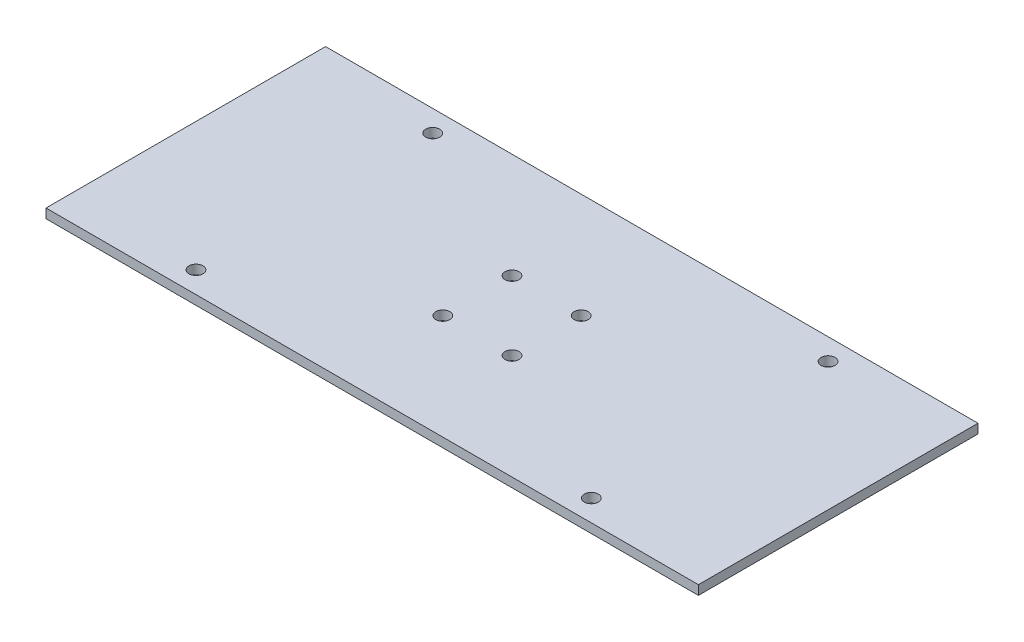
ISO-10303-21;
HEADER;
FILE_DESCRIPTION(('STEP AP214'),'2;1');
FILE_NAME('part.step','',(''),(''),'','','');
FILE_SCHEMA(('AUTOMOTIVE_DESIGN { 1 0 10303 214 1 1 1 1 }'));
ENDSEC;
DATA;
#1=APPLICATION_CONTEXT('core data for automotive mechanical design processes');
#2=APPLICATION_PROTOCOL_DEFINITION('international standard','automotive_design',2000,#1);
#3=PRODUCT_CONTEXT('',#1,'mechanical');
#4=PRODUCT('Part','Part','',(#3));
#5=PRODUCT_RELATED_PRODUCT_CATEGORY('part','',(#4));
#6=PRODUCT_DEFINITION_FORMATION('','',#4);
#7=PRODUCT_DEFINITION_CONTEXT('part definition',#1,'design');
#8=PRODUCT_DEFINITION('design','',#6,#7);
#9=PRODUCT_DEFINITION_SHAPE('','',#8);
#10=(LENGTH_UNIT() NAMED_UNIT(*) SI_UNIT(.MILLI.,.METRE.));
#11=(NAMED_UNIT(*) PLANE_ANGLE_UNIT() SI_UNIT($,.RADIAN.));
#12=(NAMED_UNIT(*) SI_UNIT($,.STERADIAN.) SOLID_ANGLE_UNIT());
#13=UNCERTAINTY_MEASURE_WITH_UNIT(LENGTH_MEASURE(1.E-05),#10,'distance_accuracy_value','');
#14=(GEOMETRIC_REPRESENTATION_CONTEXT(3) GLOBAL_UNCERTAINTY_ASSIGNED_CONTEXT((#13)) GLOBAL_UNIT_ASSIGNED_CONTEXT((#10,
#11,#12)) REPRESENTATION_CONTEXT('',''));
#15=CARTESIAN_POINT('',(0.,0.,0.));
#16=DIRECTION('',(0.,0.,1.));
#17=DIRECTION('',(1.,0.,0.));
#18=AXIS2_PLACEMENT_3D('',#15,#16,#17);
#19=CARTESIAN_POINT('',(0.,2.,0.));
#20=DIRECTION('',(0.,1.,0.));
#21=DIRECTION('',(0.,0.,1.));
#22=AXIS2_PLACEMENT_3D('',#19,#20,#21);
#23=PLANE('',#22);
#24=CARTESIAN_POINT('',(7.42499999999995,2.,7.42500000000005));
#25=DIRECTION('',(0.,1.,0.));
#26=DIRECTION('',(0.,0.,1.));
#27=AXIS2_PLACEMENT_3D('',#24,#25,#26);
#28=CIRCLE('',#27,1.5);
#29=CARTESIAN_POINT('',(7.42499999999995,2.,8.92500000000005));
#30=VERTEX_POINT('',#29);
#31=EDGE_CURVE('E174',#30,#30,#28,.T.);
#32=ORIENTED_EDGE('',*,*,#31,.F.);
#33=EDGE_LOOP('',(#32));
#34=FACE_BOUND('',#33,.T.);
#35=CARTESIAN_POINT('',(-7.425,2.,-7.425));
#36=DIRECTION('',(0.,1.,0.));
#37=DIRECTION('',(0.,0.,1.));
#38=AXIS2_PLACEMENT_3D('',#35,#36,#37);
#39=CIRCLE('',#38,1.5);
#40=CARTESIAN_POINT('',(-7.425,2.,-5.925));
#41=VERTEX_POINT('',#40);
#42=EDGE_CURVE('E158',#41,#41,#39,.T.);
#43=ORIENTED_EDGE('',*,*,#42,.F.);
#44=EDGE_LOOP('',(#43));
#45=FACE_BOUND('',#44,.T.);
#46=CARTESIAN_POINT('',(42.42,2.,25.4));
#47=DIRECTION('',(0.,1.,0.));
#48=DIRECTION('',(0.,0.,1.));
#49=AXIS2_PLACEMENT_3D('',#46,#47,#48);
#50=CIRCLE('',#49,1.5);
#51=CARTESIAN_POINT('',(42.42,2.,26.9));
#52=VERTEX_POINT('',#51);
#53=EDGE_CURVE('E142',#52,#52,#50,.T.);
#54=ORIENTED_EDGE('',*,*,#53,.F.);
#55=EDGE_LOOP('',(#54));
#56=FACE_BOUND('',#55,.T.);
#57=CARTESIAN_POINT('',(-42.42,2.,-25.4));
#58=DIRECTION('',(0.,1.,0.));
#59=DIRECTION('',(0.,0.,1.));
#60=AXIS2_PLACEMENT_3D('',#57,#58,#59);
#61=CIRCLE('',#60,1.5);
#62=CARTESIAN_POINT('',(-42.42,2.,-23.9));
#63=VERTEX_POINT('',#62);
#64=EDGE_CURVE('E112',#63,#63,#61,.T.);
#65=ORIENTED_EDGE('',*,*,#64,.F.);
#66=EDGE_LOOP('',(#65));
#67=FACE_BOUND('',#66,.T.);
#68=DIRECTION('',(0.,0.,-1.));
#69=VECTOR('',#68,1.);
#70=CARTESIAN_POINT('',(70.,2.,-30.));
#71=LINE('',#70,#69);
#72=CARTESIAN_POINT('',(70.,2.,30.));
#73=VERTEX_POINT('',#72);
#74=CARTESIAN_POINT('',(70.,2.,-30.));
#75=VERTEX_POINT('',#74);
#76=EDGE_CURVE('E92',#73,#75,#71,.T.);
#77=ORIENTED_EDGE('',*,*,#76,.T.);
#78=DIRECTION('',(-1.,0.,0.));
#79=VECTOR('',#78,1.);
#80=CARTESIAN_POINT('',(-70.,2.,-30.));
#81=LINE('',#80,#79);
#82=CARTESIAN_POINT('',(-70.,2.,-30.));
#83=VERTEX_POINT('',#82);
#84=EDGE_CURVE('E87',#75,#83,#81,.T.);
#85=ORIENTED_EDGE('',*,*,#84,.T.);
#86=DIRECTION('',(0.,0.,1.));
#87=VECTOR('',#86,1.);
#88=CARTESIAN_POINT('',(-70.,2.,-30.));
#89=LINE('',#88,#87);
#90=CARTESIAN_POINT('',(-70.,2.,30.));
#91=VERTEX_POINT('',#90);
#92=EDGE_CURVE('E90',#83,#91,#89,.T.);
#93=ORIENTED_EDGE('',*,*,#92,.T.);
#94=DIRECTION('',(1.,0.,0.));
#95=VECTOR('',#94,1.);
#96=CARTESIAN_POINT('',(-70.,2.,30.));
#97=LINE('',#96,#95);
#98=EDGE_CURVE('E57',#91,#73,#97,.T.);
#99=ORIENTED_EDGE('',*,*,#98,.T.);
#100=EDGE_LOOP('',(#77,#85,#93,#99));
#101=FACE_BOUND('',#100,.T.);
#102=CARTESIAN_POINT('',(-42.42,2.,25.4));
#103=DIRECTION('',(0.,1.,0.));
#104=DIRECTION('',(0.,0.,-1.));
#105=AXIS2_PLACEMENT_3D('',#102,#103,#104);
#106=CIRCLE('',#105,1.5);
#107=CARTESIAN_POINT('',(-42.42,2.,23.9));
#108=VERTEX_POINT('',#107);
#109=EDGE_CURVE('E134',#108,#108,#106,.T.);
#110=ORIENTED_EDGE('',*,*,#109,.F.);
#111=EDGE_LOOP('',(#110));
#112=FACE_BOUND('',#111,.T.);
#113=CARTESIAN_POINT('',(42.42,2.,-25.4));
#114=DIRECTION('',(0.,1.,0.));
#115=DIRECTION('',(0.,0.,-1.));
#116=AXIS2_PLACEMENT_3D('',#113,#114,#115);
#117=CIRCLE('',#116,1.5);
#118=CARTESIAN_POINT('',(42.42,2.,-26.9));
#119=VERTEX_POINT('',#118);
#120=EDGE_CURVE('E150',#119,#119,#117,.T.);
#121=ORIENTED_EDGE('',*,*,#120,.F.);
#122=EDGE_LOOP('',(#121));
#123=FACE_BOUND('',#122,.T.);
#124=CARTESIAN_POINT('',(7.42500000000003,2.,-7.42499999999997));
#125=DIRECTION('',(0.,1.,0.));
#126=DIRECTION('',(0.,0.,1.));
#127=AXIS2_PLACEMENT_3D('',#124,#125,#126);
#128=CIRCLE('',#127,1.5);
#129=CARTESIAN_POINT('',(7.42500000000003,2.,-5.92499999999998));
#130=VERTEX_POINT('',#129);
#131=EDGE_CURVE('E166',#130,#130,#128,.T.);
#132=ORIENTED_EDGE('',*,*,#131,.F.);
#133=EDGE_LOOP('',(#132));
#134=FACE_BOUND('',#133,.T.);
#135=CARTESIAN_POINT('',(-7.42500000000008,2.,7.42499999999992));
#136=DIRECTION('',(0.,1.,0.));
#137=DIRECTION('',(0.,0.,1.));
#138=AXIS2_PLACEMENT_3D('',#135,#136,#137);
#139=CIRCLE('',#138,1.5);
#140=CARTESIAN_POINT('',(-7.42500000000008,2.,8.92499999999992));
#141=VERTEX_POINT('',#140);
#142=EDGE_CURVE('E182',#141,#141,#139,.T.);
#143=ORIENTED_EDGE('',*,*,#142,.F.);
#144=EDGE_LOOP('',(#143));
#145=FACE_BOUND('',#144,.T.);
#146=ADVANCED_FACE('F39',(#34,#45,#56,#67,#101,#112,#123,#134,#145),#23,.T.);
#147=CARTESIAN_POINT('',(0.,0.,0.));
#148=DIRECTION('',(0.,1.,0.));
#149=DIRECTION('',(0.,0.,1.));
#150=AXIS2_PLACEMENT_3D('',#147,#148,#149);
#151=PLANE('',#150);
#152=DIRECTION('',(0.,0.,-1.));
#153=VECTOR('',#152,1.);
#154=CARTESIAN_POINT('',(70.,0.,-30.));
#155=LINE('',#154,#153);
#156=CARTESIAN_POINT('',(70.,0.,30.));
#157=VERTEX_POINT('',#156);
#158=CARTESIAN_POINT('',(70.,0.,-30.));
#159=VERTEX_POINT('',#158);
#160=EDGE_CURVE('E108',#157,#159,#155,.T.);
#161=ORIENTED_EDGE('',*,*,#160,.F.);
#162=DIRECTION('',(1.,0.,0.));
#163=VECTOR('',#162,1.);
#164=CARTESIAN_POINT('',(-70.,0.,30.));
#165=LINE('',#164,#163);
#166=CARTESIAN_POINT('',(-70.,0.,30.));
#167=VERTEX_POINT('',#166);
#168=EDGE_CURVE('E80',#167,#157,#165,.T.);
#169=ORIENTED_EDGE('',*,*,#168,.F.);
#170=DIRECTION('',(0.,0.,1.));
#171=VECTOR('',#170,1.);
#172=CARTESIAN_POINT('',(-70.,0.,-30.));
#173=LINE('',#172,#171);
#174=CARTESIAN_POINT('',(-70.,0.,-30.));
#175=VERTEX_POINT('',#174);
#176=EDGE_CURVE('E74',#175,#167,#173,.T.);
#177=ORIENTED_EDGE('',*,*,#176,.F.);
#178=DIRECTION('',(-1.,0.,0.));
#179=VECTOR('',#178,1.);
#180=CARTESIAN_POINT('',(-70.,0.,-30.));
#181=LINE('',#180,#179);
#182=EDGE_CURVE('E97',#159,#175,#181,.T.);
#183=ORIENTED_EDGE('',*,*,#182,.F.);
#184=EDGE_LOOP('',(#161,#169,#177,#183));
#185=FACE_BOUND('',#184,.T.);
#186=CARTESIAN_POINT('',(-42.42,0.,-25.4));
#187=DIRECTION('',(0.,1.,0.));
#188=DIRECTION('',(0.,0.,1.));
#189=AXIS2_PLACEMENT_3D('',#186,#187,#188);
#190=CIRCLE('',#189,1.5);
#191=CARTESIAN_POINT('',(-42.42,0.,-23.9));
#192=VERTEX_POINT('',#191);
#193=EDGE_CURVE('E130',#192,#192,#190,.T.);
#194=ORIENTED_EDGE('',*,*,#193,.T.);
#195=EDGE_LOOP('',(#194));
#196=FACE_BOUND('',#195,.T.);
#197=CARTESIAN_POINT('',(-42.42,0.,25.4));
#198=DIRECTION('',(0.,1.,0.));
#199=DIRECTION('',(0.,0.,-1.));
#200=AXIS2_PLACEMENT_3D('',#197,#198,#199);
#201=CIRCLE('',#200,1.5);
#202=CARTESIAN_POINT('',(-42.42,0.,23.9));
#203=VERTEX_POINT('',#202);
#204=EDGE_CURVE('E138',#203,#203,#201,.T.);
#205=ORIENTED_EDGE('',*,*,#204,.T.);
#206=EDGE_LOOP('',(#205));
#207=FACE_BOUND('',#206,.T.);
#208=CARTESIAN_POINT('',(42.42,0.,25.4));
#209=DIRECTION('',(0.,1.,0.));
#210=DIRECTION('',(0.,0.,1.));
#211=AXIS2_PLACEMENT_3D('',#208,#209,#210);
#212=CIRCLE('',#211,1.5);
#213=CARTESIAN_POINT('',(42.42,0.,26.9));
#214=VERTEX_POINT('',#213);
#215=EDGE_CURVE('E146',#214,#214,#212,.T.);
#216=ORIENTED_EDGE('',*,*,#215,.T.);
#217=EDGE_LOOP('',(#216));
#218=FACE_BOUND('',#217,.T.);
#219=CARTESIAN_POINT('',(42.42,0.,-25.4));
#220=DIRECTION('',(0.,1.,0.));
#221=DIRECTION('',(0.,0.,-1.));
#222=AXIS2_PLACEMENT_3D('',#219,#220,#221);
#223=CIRCLE('',#222,1.5);
#224=CARTESIAN_POINT('',(42.42,0.,-26.9));
#225=VERTEX_POINT('',#224);
#226=EDGE_CURVE('E154',#225,#225,#223,.T.);
#227=ORIENTED_EDGE('',*,*,#226,.T.);
#228=EDGE_LOOP('',(#227));
#229=FACE_BOUND('',#228,.T.);
#230=CARTESIAN_POINT('',(-7.425,0.,-7.425));
#231=DIRECTION('',(0.,1.,0.));
#232=DIRECTION('',(0.,0.,1.));
#233=AXIS2_PLACEMENT_3D('',#230,#231,#232);
#234=CIRCLE('',#233,1.5);
#235=CARTESIAN_POINT('',(-7.425,0.,-5.925));
#236=VERTEX_POINT('',#235);
#237=EDGE_CURVE('E162',#236,#236,#234,.T.);
#238=ORIENTED_EDGE('',*,*,#237,.T.);
#239=EDGE_LOOP('',(#238));
#240=FACE_BOUND('',#239,.T.);
#241=CARTESIAN_POINT('',(7.42500000000003,0.,-7.42499999999997));
#242=DIRECTION('',(0.,1.,0.));
#243=DIRECTION('',(0.,0.,1.));
#244=AXIS2_PLACEMENT_3D('',#241,#242,#243);
#245=CIRCLE('',#244,1.5);
#246=CARTESIAN_POINT('',(7.42500000000003,0.,-5.92499999999998));
#247=VERTEX_POINT('',#246);
#248=EDGE_CURVE('E170',#247,#247,#245,.T.);
#249=ORIENTED_EDGE('',*,*,#248,.T.);
#250=EDGE_LOOP('',(#249));
#251=FACE_BOUND('',#250,.T.);
#252=CARTESIAN_POINT('',(7.42499999999995,0.,7.42500000000005));
#253=DIRECTION('',(0.,1.,0.));
#254=DIRECTION('',(0.,0.,1.));
#255=AXIS2_PLACEMENT_3D('',#252,#253,#254);
#256=CIRCLE('',#255,1.5);
#257=CARTESIAN_POINT('',(7.42499999999995,0.,8.92500000000005));
#258=VERTEX_POINT('',#257);
#259=EDGE_CURVE('E178',#258,#258,#256,.T.);
#260=ORIENTED_EDGE('',*,*,#259,.T.);
#261=EDGE_LOOP('',(#260));
#262=FACE_BOUND('',#261,.T.);
#263=CARTESIAN_POINT('',(-7.42500000000008,0.,7.42499999999992));
#264=DIRECTION('',(0.,1.,0.));
#265=DIRECTION('',(0.,0.,1.));
#266=AXIS2_PLACEMENT_3D('',#263,#264,#265);
#267=CIRCLE('',#266,1.5);
#268=CARTESIAN_POINT('',(-7.42500000000008,0.,8.92499999999992));
#269=VERTEX_POINT('',#268);
#270=EDGE_CURVE('E186',#269,#269,#267,.T.);
#271=ORIENTED_EDGE('',*,*,#270,.T.);
#272=EDGE_LOOP('',(#271));
#273=FACE_BOUND('',#272,.T.);
#274=ADVANCED_FACE('F125',(#185,#196,#207,#218,#229,#240,#251,#262,#273),#151,.F.);
#275=CARTESIAN_POINT('',(70.,2.,-30.));
#276=DIRECTION('',(-1.,0.,0.));
#277=DIRECTION('',(0.,0.,1.));
#278=AXIS2_PLACEMENT_3D('',#275,#276,#277);
#279=PLANE('',#278);
#280=ORIENTED_EDGE('',*,*,#160,.T.);
#281=DIRECTION('',(0.,-1.,0.));
#282=VECTOR('',#281,1.);
#283=CARTESIAN_POINT('',(70.,2.,-30.));
#284=LINE('',#283,#282);
#285=EDGE_CURVE('E11',#75,#159,#284,.T.);
#286=ORIENTED_EDGE('',*,*,#285,.F.);
#287=ORIENTED_EDGE('',*,*,#76,.F.);
#288=DIRECTION('',(0.,-1.,0.));
#289=VECTOR('',#288,1.);
#290=CARTESIAN_POINT('',(70.,2.,30.));
#291=LINE('',#290,#289);
#292=EDGE_CURVE('E104',#73,#157,#291,.T.);
#293=ORIENTED_EDGE('',*,*,#292,.T.);
#294=EDGE_LOOP('',(#280,#286,#287,#293));
#295=FACE_BOUND('',#294,.T.);
#296=ADVANCED_FACE('F41',(#295),#279,.F.);
#297=CARTESIAN_POINT('',(-70.,2.,-30.));
#298=DIRECTION('',(0.,0.,1.));
#299=DIRECTION('',(1.,0.,0.));
#300=AXIS2_PLACEMENT_3D('',#297,#298,#299);
#301=PLANE('',#300);
#302=ORIENTED_EDGE('',*,*,#182,.T.);
#303=DIRECTION('',(0.,-1.,0.));
#304=VECTOR('',#303,1.);
#305=CARTESIAN_POINT('',(-70.,2.,-30.));
#306=LINE('',#305,#304);
#307=EDGE_CURVE('E49',#83,#175,#306,.T.);
#308=ORIENTED_EDGE('',*,*,#307,.F.);
#309=ORIENTED_EDGE('',*,*,#84,.F.);
#310=ORIENTED_EDGE('',*,*,#285,.T.);
#311=EDGE_LOOP('',(#302,#308,#309,#310));
#312=FACE_BOUND('',#311,.T.);
#313=ADVANCED_FACE('F96',(#312),#301,.F.);
#314=CARTESIAN_POINT('',(-70.,2.,-30.));
#315=DIRECTION('',(1.,0.,0.));
#316=DIRECTION('',(0.,0.,-1.));
#317=AXIS2_PLACEMENT_3D('',#314,#315,#316);
#318=PLANE('',#317);
#319=ORIENTED_EDGE('',*,*,#176,.T.);
#320=DIRECTION('',(0.,-1.,0.));
#321=VECTOR('',#320,1.);
#322=CARTESIAN_POINT('',(-70.,2.,30.));
#323=LINE('',#322,#321);
#324=EDGE_CURVE('E99',#91,#167,#323,.T.);
#325=ORIENTED_EDGE('',*,*,#324,.F.);
#326=ORIENTED_EDGE('',*,*,#92,.F.);
#327=ORIENTED_EDGE('',*,*,#307,.T.);
#328=EDGE_LOOP('',(#319,#325,#326,#327));
#329=FACE_BOUND('',#328,.T.);
#330=ADVANCED_FACE('F100',(#329),#318,.F.);
#331=CARTESIAN_POINT('',(-70.,2.,30.));
#332=DIRECTION('',(0.,0.,-1.));
#333=DIRECTION('',(-1.,0.,0.));
#334=AXIS2_PLACEMENT_3D('',#331,#332,#333);
#335=PLANE('',#334);
#336=ORIENTED_EDGE('',*,*,#168,.T.);
#337=ORIENTED_EDGE('',*,*,#292,.F.);
#338=ORIENTED_EDGE('',*,*,#98,.F.);
#339=ORIENTED_EDGE('',*,*,#324,.T.);
#340=EDGE_LOOP('',(#336,#337,#338,#339));
#341=FACE_BOUND('',#340,.T.);
#342=ADVANCED_FACE('F122',(#341),#335,.F.);
#343=CARTESIAN_POINT('',(-42.42,2.,-25.4));
#344=DIRECTION('',(0.,-1.,0.));
#345=DIRECTION('',(0.,0.,-1.));
#346=AXIS2_PLACEMENT_3D('',#343,#344,#345);
#347=CYLINDRICAL_SURFACE('',#346,1.5);
#348=ORIENTED_EDGE('',*,*,#64,.T.);
#349=EDGE_LOOP('',(#348));
#350=FACE_BOUND('',#349,.T.);
#351=ORIENTED_EDGE('',*,*,#193,.F.);
#352=EDGE_LOOP('',(#351));
#353=FACE_BOUND('',#352,.T.);
#354=ADVANCED_FACE('F207',(#350,#353),#347,.F.);
#355=CARTESIAN_POINT('',(-42.42,2.,25.4));
#356=DIRECTION('',(0.,-1.,0.));
#357=DIRECTION('',(0.,0.,-1.));
#358=AXIS2_PLACEMENT_3D('',#355,#356,#357);
#359=CYLINDRICAL_SURFACE('',#358,1.5);
#360=ORIENTED_EDGE('',*,*,#109,.T.);
#361=EDGE_LOOP('',(#360));
#362=FACE_BOUND('',#361,.T.);
#363=ORIENTED_EDGE('',*,*,#204,.F.);
#364=EDGE_LOOP('',(#363));
#365=FACE_BOUND('',#364,.T.);
#366=ADVANCED_FACE('F253',(#362,#365),#359,.F.);
#367=CARTESIAN_POINT('',(42.42,2.,25.4));
#368=DIRECTION('',(0.,-1.,0.));
#369=DIRECTION('',(0.,0.,-1.));
#370=AXIS2_PLACEMENT_3D('',#367,#368,#369);
#371=CYLINDRICAL_SURFACE('',#370,1.5);
#372=ORIENTED_EDGE('',*,*,#53,.T.);
#373=EDGE_LOOP('',(#372));
#374=FACE_BOUND('',#373,.T.);
#375=ORIENTED_EDGE('',*,*,#215,.F.);
#376=EDGE_LOOP('',(#375));
#377=FACE_BOUND('',#376,.T.);
#378=ADVANCED_FACE('F261',(#374,#377),#371,.F.);
#379=CARTESIAN_POINT('',(42.42,2.,-25.4));
#380=DIRECTION('',(0.,-1.,0.));
#381=DIRECTION('',(0.,0.,-1.));
#382=AXIS2_PLACEMENT_3D('',#379,#380,#381);
#383=CYLINDRICAL_SURFACE('',#382,1.5);
#384=ORIENTED_EDGE('',*,*,#120,.T.);
#385=EDGE_LOOP('',(#384));
#386=FACE_BOUND('',#385,.T.);
#387=ORIENTED_EDGE('',*,*,#226,.F.);
#388=EDGE_LOOP('',(#387));
#389=FACE_BOUND('',#388,.T.);
#390=ADVANCED_FACE('F269',(#386,#389),#383,.F.);
#391=CARTESIAN_POINT('',(-7.425,2.,-7.425));
#392=DIRECTION('',(0.,-1.,0.));
#393=DIRECTION('',(0.,0.,-1.));
#394=AXIS2_PLACEMENT_3D('',#391,#392,#393);
#395=CYLINDRICAL_SURFACE('',#394,1.5);
#396=ORIENTED_EDGE('',*,*,#42,.T.);
#397=EDGE_LOOP('',(#396));
#398=FACE_BOUND('',#397,.T.);
#399=ORIENTED_EDGE('',*,*,#237,.F.);
#400=EDGE_LOOP('',(#399));
#401=FACE_BOUND('',#400,.T.);
#402=ADVANCED_FACE('F278',(#398,#401),#395,.F.);
#403=CARTESIAN_POINT('',(7.42500000000003,2.,-7.42499999999997));
#404=DIRECTION('',(0.,-1.,0.));
#405=DIRECTION('',(0.,0.,-1.));
#406=AXIS2_PLACEMENT_3D('',#403,#404,#405);
#407=CYLINDRICAL_SURFACE('',#406,1.5);
#408=ORIENTED_EDGE('',*,*,#131,.T.);
#409=EDGE_LOOP('',(#408));
#410=FACE_BOUND('',#409,.T.);
#411=ORIENTED_EDGE('',*,*,#248,.F.);
#412=EDGE_LOOP('',(#411));
#413=FACE_BOUND('',#412,.T.);
#414=ADVANCED_FACE('F287',(#410,#413),#407,.F.);
#415=CARTESIAN_POINT('',(7.42499999999995,2.,7.42500000000005));
#416=DIRECTION('',(0.,-1.,0.));
#417=DIRECTION('',(0.,0.,-1.));
#418=AXIS2_PLACEMENT_3D('',#415,#416,#417);
#419=CYLINDRICAL_SURFACE('',#418,1.5);
#420=ORIENTED_EDGE('',*,*,#31,.T.);
#421=EDGE_LOOP('',(#420));
#422=FACE_BOUND('',#421,.T.);
#423=ORIENTED_EDGE('',*,*,#259,.F.);
#424=EDGE_LOOP('',(#423));
#425=FACE_BOUND('',#424,.T.);
#426=ADVANCED_FACE('F296',(#422,#425),#419,.F.);
#427=CARTESIAN_POINT('',(-7.42500000000008,2.,7.42499999999992));
#428=DIRECTION('',(0.,-1.,0.));
#429=DIRECTION('',(0.,0.,-1.));
#430=AXIS2_PLACEMENT_3D('',#427,#428,#429);
#431=CYLINDRICAL_SURFACE('',#430,1.5);
#432=ORIENTED_EDGE('',*,*,#142,.T.);
#433=EDGE_LOOP('',(#432));
#434=FACE_BOUND('',#433,.T.);
#435=ORIENTED_EDGE('',*,*,#270,.F.);
#436=EDGE_LOOP('',(#435));
#437=FACE_BOUND('',#436,.T.);
#438=ADVANCED_FACE('F194',(#434,#437),#431,.F.);
#439=CLOSED_SHELL('',(#146,#274,#296,#313,#330,#342,#354,#366,#378,#390,#402,#414,#426,#438));
#440=MANIFOLD_SOLID_BREP('B2',#439);
#441=ADVANCED_BREP_SHAPE_REPRESENTATION('',(#18,#440),#14);
#442=SHAPE_DEFINITION_REPRESENTATION(#9,#441);
ENDSEC;
END-ISO-10303-21;
